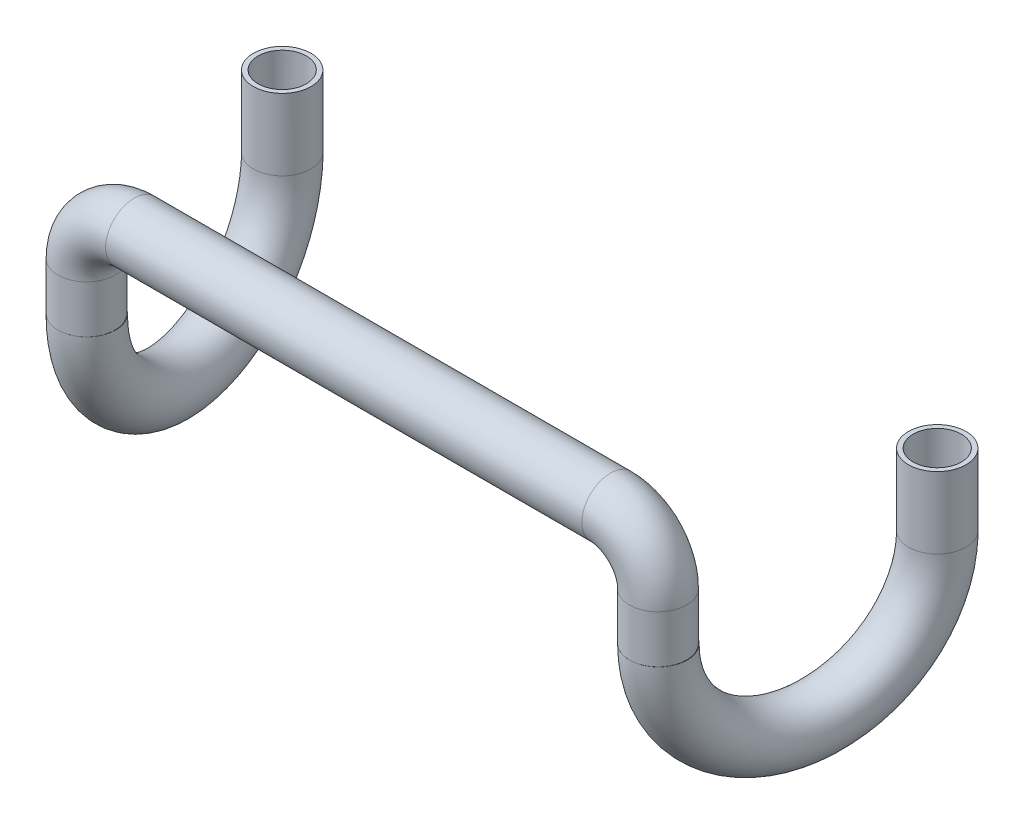
ISO-10303-21;
HEADER;
FILE_DESCRIPTION(('STEP AP214'),'2;1');
FILE_NAME('part.step','',(''),(''),'','','');
FILE_SCHEMA(('AUTOMOTIVE_DESIGN { 1 0 10303 214 1 1 1 1 }'));
ENDSEC;
DATA;
#1=APPLICATION_CONTEXT('core data for automotive mechanical design processes');
#2=APPLICATION_PROTOCOL_DEFINITION('international standard','automotive_design',2000,#1);
#3=PRODUCT_CONTEXT('',#1,'mechanical');
#4=PRODUCT('Part','Part','',(#3));
#5=PRODUCT_RELATED_PRODUCT_CATEGORY('part','',(#4));
#6=PRODUCT_DEFINITION_FORMATION('','',#4);
#7=PRODUCT_DEFINITION_CONTEXT('part definition',#1,'design');
#8=PRODUCT_DEFINITION('design','',#6,#7);
#9=PRODUCT_DEFINITION_SHAPE('','',#8);
#10=(LENGTH_UNIT() NAMED_UNIT(*) SI_UNIT(.MILLI.,.METRE.));
#11=(NAMED_UNIT(*) PLANE_ANGLE_UNIT() SI_UNIT($,.RADIAN.));
#12=(NAMED_UNIT(*) SI_UNIT($,.STERADIAN.) SOLID_ANGLE_UNIT());
#13=UNCERTAINTY_MEASURE_WITH_UNIT(LENGTH_MEASURE(1.E-05),#10,'distance_accuracy_value','');
#14=(GEOMETRIC_REPRESENTATION_CONTEXT(3) GLOBAL_UNCERTAINTY_ASSIGNED_CONTEXT((#13)) GLOBAL_UNIT_ASSIGNED_CONTEXT((#10,
#11,#12)) REPRESENTATION_CONTEXT('',''));
#15=CARTESIAN_POINT('',(0.,0.,0.));
#16=DIRECTION('',(0.,0.,1.));
#17=DIRECTION('',(1.,0.,0.));
#18=AXIS2_PLACEMENT_3D('',#15,#16,#17);
#19=CARTESIAN_POINT('',(0.,0.,0.));
#20=DIRECTION('',(1.,0.,0.));
#21=DIRECTION('',(0.,0.,-1.));
#22=AXIS2_PLACEMENT_3D('',#19,#20,#21);
#23=CYLINDRICAL_SURFACE('',#22,24.);
#24=CARTESIAN_POINT('',(200.,0.,0.));
#25=DIRECTION('',(1.,0.,0.));
#26=DIRECTION('',(0.,0.,-1.));
#27=AXIS2_PLACEMENT_3D('',#24,#25,#26);
#28=CIRCLE('',#27,24.);
#29=CARTESIAN_POINT('',(200.,24.,0.));
#30=VERTEX_POINT('',#29);
#31=EDGE_CURVE('E99',#30,#30,#28,.T.);
#32=ORIENTED_EDGE('',*,*,#31,.F.);
#33=EDGE_LOOP('',(#32));
#34=FACE_BOUND('',#33,.T.);
#35=CARTESIAN_POINT('',(-200.,0.,0.));
#36=DIRECTION('',(1.,0.,0.));
#37=DIRECTION('',(0.,0.,-1.));
#38=AXIS2_PLACEMENT_3D('',#35,#36,#37);
#39=CIRCLE('',#38,24.);
#40=CARTESIAN_POINT('',(-200.,24.,0.));
#41=VERTEX_POINT('',#40);
#42=EDGE_CURVE('E83',#41,#41,#39,.F.);
#43=ORIENTED_EDGE('',*,*,#42,.F.);
#44=EDGE_LOOP('',(#43));
#45=FACE_BOUND('',#44,.T.);
#46=ADVANCED_FACE('F34',(#34,#45),#23,.T.);
#47=CARTESIAN_POINT('',(200.,-40.,0.));
#48=DIRECTION('',(0.,0.,-1.));
#49=DIRECTION('',(-1.,0.,0.));
#50=AXIS2_PLACEMENT_3D('',#47,#48,#49);
#51=TOROIDAL_SURFACE('',#50,40.,24.);
#52=CARTESIAN_POINT('',(240.,-40.,0.));
#53=DIRECTION('',(0.,-1.,0.));
#54=DIRECTION('',(0.,0.,-1.));
#55=AXIS2_PLACEMENT_3D('',#52,#53,#54);
#56=CIRCLE('',#55,24.);
#57=CARTESIAN_POINT('',(264.,-40.,0.));
#58=VERTEX_POINT('',#57);
#59=EDGE_CURVE('E38',#58,#58,#56,.T.);
#60=CARTESIAN_POINT('',(200.,-40.,0.));
#61=DIRECTION('',(0.,0.,-1.));
#62=DIRECTION('',(-1.,0.,0.));
#63=AXIS2_PLACEMENT_3D('',#60,#61,#62);
#64=CIRCLE('',#63,64.);
#65=EDGE_CURVE('',#30,#58,#64,.T.);
#66=ORIENTED_EDGE('',*,*,#31,.T.);
#67=ORIENTED_EDGE('',*,*,#59,.F.);
#68=ORIENTED_EDGE('',*,*,#65,.T.);
#69=ORIENTED_EDGE('',*,*,#65,.F.);
#70=EDGE_LOOP('',(#66,#68,#67,#69));
#71=FACE_BOUND('',#70,.T.);
#72=ADVANCED_FACE('F116',(#71),#51,.T.);
#73=CARTESIAN_POINT('',(240.,-40.,0.));
#74=DIRECTION('',(0.,-1.,0.));
#75=DIRECTION('',(1.,0.,0.));
#76=AXIS2_PLACEMENT_3D('',#73,#74,#75);
#77=CYLINDRICAL_SURFACE('',#76,24.);
#78=CARTESIAN_POINT('',(240.,-80.,0.));
#79=DIRECTION('',(0.,-1.,0.));
#80=DIRECTION('',(0.,0.,-1.));
#81=AXIS2_PLACEMENT_3D('',#78,#79,#80);
#82=CIRCLE('',#81,24.);
#83=CARTESIAN_POINT('',(235.84098963481,-80.,23.6368913519153));
#84=VERTEX_POINT('',#83);
#85=EDGE_CURVE('E54',#84,#84,#82,.T.);
#86=ORIENTED_EDGE('',*,*,#85,.F.);
#87=EDGE_LOOP('',(#86));
#88=FACE_BOUND('',#87,.T.);
#89=ORIENTED_EDGE('',*,*,#59,.T.);
#90=EDGE_LOOP('',(#89));
#91=FACE_BOUND('',#90,.T.);
#92=ADVANCED_FACE('F36',(#88,#91),#77,.T.);
#93=CARTESIAN_POINT('',(0.,0.,0.));
#94=DIRECTION('',(1.,0.,0.));
#95=DIRECTION('',(0.,0.,-1.));
#96=AXIS2_PLACEMENT_3D('',#93,#94,#95);
#97=CYLINDRICAL_SURFACE('',#96,20.483873115775);
#98=CARTESIAN_POINT('',(200.,0.,0.));
#99=DIRECTION('',(1.,0.,0.));
#100=DIRECTION('',(0.,0.,-1.));
#101=AXIS2_PLACEMENT_3D('',#98,#99,#100);
#102=CIRCLE('',#101,20.483873115775);
#103=CARTESIAN_POINT('',(200.,20.483873115775,0.));
#104=VERTEX_POINT('',#103);
#105=EDGE_CURVE('E104',#104,#104,#102,.F.);
#106=ORIENTED_EDGE('',*,*,#105,.F.);
#107=EDGE_LOOP('',(#106));
#108=FACE_BOUND('',#107,.T.);
#109=CARTESIAN_POINT('',(-200.,0.,0.));
#110=DIRECTION('',(1.,0.,0.));
#111=DIRECTION('',(0.,0.,-1.));
#112=AXIS2_PLACEMENT_3D('',#109,#110,#111);
#113=CIRCLE('',#112,20.483873115775);
#114=CARTESIAN_POINT('',(-200.,20.483873115775,0.));
#115=VERTEX_POINT('',#114);
#116=EDGE_CURVE('E75',#115,#115,#113,.T.);
#117=ORIENTED_EDGE('',*,*,#116,.F.);
#118=EDGE_LOOP('',(#117));
#119=FACE_BOUND('',#118,.T.);
#120=ADVANCED_FACE('F122',(#108,#119),#97,.F.);
#121=CARTESIAN_POINT('',(200.,-40.,0.));
#122=DIRECTION('',(0.,0.,-1.));
#123=DIRECTION('',(-1.,0.,0.));
#124=AXIS2_PLACEMENT_3D('',#121,#122,#123);
#125=TOROIDAL_SURFACE('',#124,40.,20.483873115775);
#126=CARTESIAN_POINT('',(240.,-40.,0.));
#127=DIRECTION('',(0.,-1.,0.));
#128=DIRECTION('',(0.,0.,-1.));
#129=AXIS2_PLACEMENT_3D('',#126,#127,#128);
#130=CIRCLE('',#129,20.483873115775);
#131=CARTESIAN_POINT('',(260.483873115775,-40.,0.));
#132=VERTEX_POINT('',#131);
#133=EDGE_CURVE('E43',#132,#132,#130,.F.);
#134=CARTESIAN_POINT('',(200.,-40.,0.));
#135=DIRECTION('',(0.,0.,-1.));
#136=DIRECTION('',(-1.,0.,0.));
#137=AXIS2_PLACEMENT_3D('',#134,#135,#136);
#138=CIRCLE('',#137,60.483873115775);
#139=EDGE_CURVE('',#104,#132,#138,.T.);
#140=ORIENTED_EDGE('',*,*,#105,.T.);
#141=ORIENTED_EDGE('',*,*,#133,.F.);
#142=ORIENTED_EDGE('',*,*,#139,.T.);
#143=ORIENTED_EDGE('',*,*,#139,.F.);
#144=EDGE_LOOP('',(#140,#142,#141,#143));
#145=FACE_BOUND('',#144,.T.);
#146=ADVANCED_FACE('F128',(#145),#125,.F.);
#147=CARTESIAN_POINT('',(240.,-40.,0.));
#148=DIRECTION('',(0.,-1.,0.));
#149=DIRECTION('',(1.,0.,0.));
#150=AXIS2_PLACEMENT_3D('',#147,#148,#149);
#151=CYLINDRICAL_SURFACE('',#150,20.483873115775);
#152=CARTESIAN_POINT('',(240.,-80.,0.));
#153=DIRECTION('',(0.,-1.,0.));
#154=DIRECTION('',(0.,0.,-1.));
#155=AXIS2_PLACEMENT_3D('',#152,#153,#154);
#156=CIRCLE('',#155,20.483873115775);
#157=CARTESIAN_POINT('',(243.549693358655,-80.,-20.173961804333));
#158=VERTEX_POINT('',#157);
#159=EDGE_CURVE('E11',#158,#158,#156,.F.);
#160=ORIENTED_EDGE('',*,*,#159,.F.);
#161=EDGE_LOOP('',(#160));
#162=FACE_BOUND('',#161,.T.);
#163=ORIENTED_EDGE('',*,*,#133,.T.);
#164=EDGE_LOOP('',(#163));
#165=FACE_BOUND('',#164,.T.);
#166=ADVANCED_FACE('F126',(#162,#165),#151,.F.);
#167=CARTESIAN_POINT('',(240.035474595347,-80.,-0.201612663195141));
#168=DIRECTION('',(0.,-1.,0.));
#169=DIRECTION('',(1.,0.,0.));
#170=AXIS2_PLACEMENT_3D('',#167,#168,#169);
#171=PLANE('',#170);
#172=CARTESIAN_POINT('',(240.035474595347,-80.,-0.201612663195141));
#173=DIRECTION('',(0.,-1.,0.));
#174=DIRECTION('',(1.,0.,0.));
#175=AXIS2_PLACEMENT_3D('',#172,#173,#174);
#176=CIRCLE('',#175,24.2047098260361);
#177=EDGE_CURVE('E90',#84,#84,#176,.T.);
#178=ORIENTED_EDGE('',*,*,#177,.F.);
#179=ORIENTED_EDGE('',*,*,#85,.T.);
#180=EDGE_LOOP('',(#178,#179));
#181=FACE_BOUND('',#180,.T.);
#182=ADVANCED_FACE('F125',(#181),#171,.F.);
#183=CARTESIAN_POINT('',(240.035474595347,-80.,-0.201612663195141));
#184=DIRECTION('',(0.,-1.,0.));
#185=DIRECTION('',(1.,0.,0.));
#186=AXIS2_PLACEMENT_3D('',#183,#184,#185);
#187=CIRCLE('',#186,20.279163289739);
#188=EDGE_CURVE('E92',#158,#158,#187,.F.);
#189=ORIENTED_EDGE('',*,*,#188,.F.);
#190=ORIENTED_EDGE('',*,*,#159,.T.);
#191=EDGE_LOOP('',(#189,#190));
#192=FACE_BOUND('',#191,.T.);
#193=ADVANCED_FACE('F135',(#192),#171,.F.);
#194=CARTESIAN_POINT('',(257.561421105602,-80.,-99.8067728164823));
#195=DIRECTION('',(0.984870472996578,0.,0.173292098548945));
#196=DIRECTION('',(0.173292098548945,0.,-0.984870472996578));
#197=AXIS2_PLACEMENT_3D('',#194,#195,#196);
#198=TOROIDAL_SURFACE('',#197,101.135289242886,24.2047098260361);
#199=CARTESIAN_POINT('',(275.087367615856,-80.,-199.411932969769));
#200=DIRECTION('',(0.,1.,0.));
#201=DIRECTION('',(0.939939697161005,0.,0.341340542128938));
#202=AXIS2_PLACEMENT_3D('',#199,#200,#201);
#203=CIRCLE('',#202,24.2047098260361);
#204=CARTESIAN_POINT('',(297.83833523961,-80.,-191.149884195677));
#205=VERTEX_POINT('',#204);
#206=EDGE_CURVE('E96',#205,#205,#203,.T.);
#207=ORIENTED_EDGE('',*,*,#206,.F.);
#208=EDGE_LOOP('',(#207));
#209=FACE_BOUND('',#208,.T.);
#210=ORIENTED_EDGE('',*,*,#177,.T.);
#211=EDGE_LOOP('',(#210));
#212=FACE_BOUND('',#211,.T.);
#213=ADVANCED_FACE('F145',(#209,#212),#198,.T.);
#214=CARTESIAN_POINT('',(257.561421105602,-80.,-99.8067728164823));
#215=DIRECTION('',(0.984870472996578,0.,0.173292098548945));
#216=DIRECTION('',(0.173292098548945,0.,-0.984870472996578));
#217=AXIS2_PLACEMENT_3D('',#214,#215,#216);
#218=TOROIDAL_SURFACE('',#217,101.135289242886,20.279163289739);
#219=CARTESIAN_POINT('',(275.087367615856,-80.,-199.411932969769));
#220=DIRECTION('',(0.,1.,0.));
#221=DIRECTION('',(0.939939697161005,0.,0.341340542128938));
#222=AXIS2_PLACEMENT_3D('',#219,#220,#221);
#223=CIRCLE('',#222,20.279163289739);
#224=CARTESIAN_POINT('',(294.148558217092,-80.,-192.489832378529));
#225=VERTEX_POINT('',#224);
#226=EDGE_CURVE('E95',#225,#225,#223,.F.);
#227=ORIENTED_EDGE('',*,*,#226,.F.);
#228=EDGE_LOOP('',(#227));
#229=FACE_BOUND('',#228,.T.);
#230=ORIENTED_EDGE('',*,*,#188,.T.);
#231=EDGE_LOOP('',(#230));
#232=FACE_BOUND('',#231,.T.);
#233=ADVANCED_FACE('F147',(#229,#232),#218,.F.);
#234=CARTESIAN_POINT('',(275.087367615856,-80.,-199.411932969769));
#235=DIRECTION('',(0.,1.,0.));
#236=DIRECTION('',(-1.,0.,0.));
#237=AXIS2_PLACEMENT_3D('',#234,#235,#236);
#238=CYLINDRICAL_SURFACE('',#237,24.2047098260361);
#239=CARTESIAN_POINT('',(275.087367615856,-19.9999999999999,-199.411932969769));
#240=DIRECTION('',(0.,1.,0.));
#241=DIRECTION('',(-1.,0.,0.));
#242=AXIS2_PLACEMENT_3D('',#239,#240,#241);
#243=CIRCLE('',#242,24.2047098260361);
#244=CARTESIAN_POINT('',(250.88265778982,-19.9999999999999,-199.411932969769));
#245=VERTEX_POINT('',#244);
#246=EDGE_CURVE('E68',#245,#245,#243,.T.);
#247=ORIENTED_EDGE('',*,*,#246,.F.);
#248=EDGE_LOOP('',(#247));
#249=FACE_BOUND('',#248,.T.);
#250=ORIENTED_EDGE('',*,*,#206,.T.);
#251=EDGE_LOOP('',(#250));
#252=FACE_BOUND('',#251,.T.);
#253=ADVANCED_FACE('F153',(#249,#252),#238,.T.);
#254=CARTESIAN_POINT('',(275.087367615856,-19.9999999999999,-199.411932969769));
#255=DIRECTION('',(0.,1.,0.));
#256=DIRECTION('',(-1.,0.,0.));
#257=AXIS2_PLACEMENT_3D('',#254,#255,#256);
#258=PLANE('',#257);
#259=CARTESIAN_POINT('',(275.087367615856,-19.9999999999999,-199.411932969769));
#260=DIRECTION('',(0.,1.,0.));
#261=DIRECTION('',(-1.,0.,0.));
#262=AXIS2_PLACEMENT_3D('',#259,#260,#261);
#263=CIRCLE('',#262,20.279163289739);
#264=CARTESIAN_POINT('',(254.808204326117,-19.9999999999999,-199.411932969769));
#265=VERTEX_POINT('',#264);
#266=EDGE_CURVE('E72',#265,#265,#263,.F.);
#267=ORIENTED_EDGE('',*,*,#266,.T.);
#268=EDGE_LOOP('',(#267));
#269=FACE_BOUND('',#268,.T.);
#270=ORIENTED_EDGE('',*,*,#246,.T.);
#271=EDGE_LOOP('',(#270));
#272=FACE_BOUND('',#271,.T.);
#273=ADVANCED_FACE('F157',(#269,#272),#258,.T.);
#274=CARTESIAN_POINT('',(275.087367615856,-80.,-199.411932969769));
#275=DIRECTION('',(0.,1.,0.));
#276=DIRECTION('',(-1.,0.,0.));
#277=AXIS2_PLACEMENT_3D('',#274,#275,#276);
#278=CYLINDRICAL_SURFACE('',#277,20.279163289739);
#279=ORIENTED_EDGE('',*,*,#266,.F.);
#280=EDGE_LOOP('',(#279));
#281=FACE_BOUND('',#280,.T.);
#282=ORIENTED_EDGE('',*,*,#226,.T.);
#283=EDGE_LOOP('',(#282));
#284=FACE_BOUND('',#283,.T.);
#285=ADVANCED_FACE('F149',(#281,#284),#278,.F.);
#286=CARTESIAN_POINT('',(-200.,-40.,0.));
#287=DIRECTION('',(0.,0.,1.));
#288=DIRECTION('',(1.,0.,0.));
#289=AXIS2_PLACEMENT_3D('',#286,#287,#288);
#290=TOROIDAL_SURFACE('',#289,40.,24.);
#291=CARTESIAN_POINT('',(-240.,-40.,0.));
#292=DIRECTION('',(0.,1.,0.));
#293=DIRECTION('',(0.,0.,-1.));
#294=AXIS2_PLACEMENT_3D('',#291,#292,#293);
#295=CIRCLE('',#294,24.);
#296=CARTESIAN_POINT('',(-264.,-40.,0.));
#297=VERTEX_POINT('',#296);
#298=EDGE_CURVE('E82',#297,#297,#295,.F.);
#299=CARTESIAN_POINT('',(-200.,-40.,0.));
#300=DIRECTION('',(0.,0.,1.));
#301=DIRECTION('',(1.,0.,0.));
#302=AXIS2_PLACEMENT_3D('',#299,#300,#301);
#303=CIRCLE('',#302,64.);
#304=EDGE_CURVE('',#41,#297,#303,.T.);
#305=ORIENTED_EDGE('',*,*,#42,.T.);
#306=ORIENTED_EDGE('',*,*,#298,.F.);
#307=ORIENTED_EDGE('',*,*,#304,.T.);
#308=ORIENTED_EDGE('',*,*,#304,.F.);
#309=EDGE_LOOP('',(#305,#307,#306,#308));
#310=FACE_BOUND('',#309,.T.);
#311=ADVANCED_FACE('F164',(#310),#290,.T.);
#312=CARTESIAN_POINT('',(-240.,-40.,0.));
#313=DIRECTION('',(0.,-1.,0.));
#314=DIRECTION('',(1.,0.,0.));
#315=AXIS2_PLACEMENT_3D('',#312,#313,#314);
#316=CYLINDRICAL_SURFACE('',#315,24.);
#317=CARTESIAN_POINT('',(-240.,-80.,0.));
#318=DIRECTION('',(0.,1.,0.));
#319=DIRECTION('',(0.,0.,-1.));
#320=AXIS2_PLACEMENT_3D('',#317,#318,#319);
#321=CIRCLE('',#320,24.);
#322=CARTESIAN_POINT('',(-235.84098963481,-80.,23.6368913519153));
#323=VERTEX_POINT('',#322);
#324=EDGE_CURVE('E79',#323,#323,#321,.T.);
#325=ORIENTED_EDGE('',*,*,#324,.T.);
#326=EDGE_LOOP('',(#325));
#327=FACE_BOUND('',#326,.T.);
#328=ORIENTED_EDGE('',*,*,#298,.T.);
#329=EDGE_LOOP('',(#328));
#330=FACE_BOUND('',#329,.T.);
#331=ADVANCED_FACE('F166',(#327,#330),#316,.T.);
#332=CARTESIAN_POINT('',(-200.,-40.,0.));
#333=DIRECTION('',(0.,0.,1.));
#334=DIRECTION('',(1.,0.,0.));
#335=AXIS2_PLACEMENT_3D('',#332,#333,#334);
#336=TOROIDAL_SURFACE('',#335,40.,20.483873115775);
#337=CARTESIAN_POINT('',(-240.,-40.,0.));
#338=DIRECTION('',(0.,1.,0.));
#339=DIRECTION('',(0.,0.,-1.));
#340=AXIS2_PLACEMENT_3D('',#337,#338,#339);
#341=CIRCLE('',#340,20.483873115775);
#342=CARTESIAN_POINT('',(-260.483873115775,-40.,0.));
#343=VERTEX_POINT('',#342);
#344=EDGE_CURVE('E69',#343,#343,#341,.T.);
#345=CARTESIAN_POINT('',(-200.,-40.,0.));
#346=DIRECTION('',(0.,0.,1.));
#347=DIRECTION('',(1.,0.,0.));
#348=AXIS2_PLACEMENT_3D('',#345,#346,#347);
#349=CIRCLE('',#348,60.483873115775);
#350=EDGE_CURVE('',#115,#343,#349,.T.);
#351=ORIENTED_EDGE('',*,*,#116,.T.);
#352=ORIENTED_EDGE('',*,*,#344,.F.);
#353=ORIENTED_EDGE('',*,*,#350,.T.);
#354=ORIENTED_EDGE('',*,*,#350,.F.);
#355=EDGE_LOOP('',(#351,#353,#352,#354));
#356=FACE_BOUND('',#355,.T.);
#357=ADVANCED_FACE('F169',(#356),#336,.F.);
#358=CARTESIAN_POINT('',(-240.,-40.,0.));
#359=DIRECTION('',(0.,-1.,0.));
#360=DIRECTION('',(1.,0.,0.));
#361=AXIS2_PLACEMENT_3D('',#358,#359,#360);
#362=CYLINDRICAL_SURFACE('',#361,20.483873115775);
#363=CARTESIAN_POINT('',(-240.,-80.,0.));
#364=DIRECTION('',(0.,1.,0.));
#365=DIRECTION('',(0.,0.,-1.));
#366=AXIS2_PLACEMENT_3D('',#363,#364,#365);
#367=CIRCLE('',#366,20.483873115775);
#368=CARTESIAN_POINT('',(-243.549693358655,-80.,-20.173961804333));
#369=VERTEX_POINT('',#368);
#370=EDGE_CURVE('E62',#369,#369,#367,.T.);
#371=ORIENTED_EDGE('',*,*,#370,.F.);
#372=EDGE_LOOP('',(#371));
#373=FACE_BOUND('',#372,.T.);
#374=ORIENTED_EDGE('',*,*,#344,.T.);
#375=EDGE_LOOP('',(#374));
#376=FACE_BOUND('',#375,.T.);
#377=ADVANCED_FACE('F63',(#373,#376),#362,.F.);
#378=CARTESIAN_POINT('',(-240.035474595347,-80.,-0.201612663195141));
#379=DIRECTION('',(0.,-1.,0.));
#380=DIRECTION('',(-1.,0.,0.));
#381=AXIS2_PLACEMENT_3D('',#378,#379,#380);
#382=PLANE('',#381);
#383=CARTESIAN_POINT('',(-240.035474595347,-80.,-0.201612663195141));
#384=DIRECTION('',(0.,1.,0.));
#385=DIRECTION('',(-1.,0.,0.));
#386=AXIS2_PLACEMENT_3D('',#383,#384,#385);
#387=CIRCLE('',#386,24.2047098260361);
#388=EDGE_CURVE('E49',#323,#323,#387,.T.);
#389=ORIENTED_EDGE('',*,*,#388,.T.);
#390=ORIENTED_EDGE('',*,*,#324,.F.);
#391=EDGE_LOOP('',(#389,#390));
#392=FACE_BOUND('',#391,.T.);
#393=ADVANCED_FACE('F174',(#392),#382,.F.);
#394=CARTESIAN_POINT('',(-240.035474595347,-80.,-0.201612663195141));
#395=DIRECTION('',(0.,1.,0.));
#396=DIRECTION('',(-1.,0.,0.));
#397=AXIS2_PLACEMENT_3D('',#394,#395,#396);
#398=CIRCLE('',#397,20.279163289739);
#399=EDGE_CURVE('E211',#369,#369,#398,.T.);
#400=ORIENTED_EDGE('',*,*,#399,.F.);
#401=ORIENTED_EDGE('',*,*,#370,.T.);
#402=EDGE_LOOP('',(#400,#401));
#403=FACE_BOUND('',#402,.T.);
#404=ADVANCED_FACE('F184',(#403),#382,.F.);
#405=CARTESIAN_POINT('',(-257.561421105602,-80.,-99.8067728164823));
#406=DIRECTION('',(0.984870472996578,0.,-0.173292098548945));
#407=DIRECTION('',(-0.173292098548945,0.,-0.984870472996578));
#408=AXIS2_PLACEMENT_3D('',#405,#406,#407);
#409=TOROIDAL_SURFACE('',#408,101.135289242886,24.2047098260361);
#410=CARTESIAN_POINT('',(-275.087367615856,-80.,-199.411932969769));
#411=DIRECTION('',(0.,-1.,0.));
#412=DIRECTION('',(-0.939939697161005,0.,0.341340542128938));
#413=AXIS2_PLACEMENT_3D('',#410,#411,#412);
#414=CIRCLE('',#413,24.2047098260361);
#415=CARTESIAN_POINT('',(-297.83833523961,-80.,-191.149884195677));
#416=VERTEX_POINT('',#415);
#417=EDGE_CURVE('E213',#416,#416,#414,.T.);
#418=ORIENTED_EDGE('',*,*,#417,.T.);
#419=EDGE_LOOP('',(#418));
#420=FACE_BOUND('',#419,.T.);
#421=ORIENTED_EDGE('',*,*,#388,.F.);
#422=EDGE_LOOP('',(#421));
#423=FACE_BOUND('',#422,.T.);
#424=ADVANCED_FACE('F180',(#420,#423),#409,.T.);
#425=CARTESIAN_POINT('',(-257.561421105602,-80.,-99.8067728164823));
#426=DIRECTION('',(0.984870472996578,0.,-0.173292098548945));
#427=DIRECTION('',(-0.173292098548945,0.,-0.984870472996578));
#428=AXIS2_PLACEMENT_3D('',#425,#426,#427);
#429=TOROIDAL_SURFACE('',#428,101.135289242886,20.279163289739);
#430=CARTESIAN_POINT('',(-275.087367615856,-80.,-199.411932969769));
#431=DIRECTION('',(0.,-1.,0.));
#432=DIRECTION('',(-0.939939697161005,0.,0.341340542128938));
#433=AXIS2_PLACEMENT_3D('',#430,#431,#432);
#434=CIRCLE('',#433,20.279163289739);
#435=CARTESIAN_POINT('',(-294.148558217092,-80.,-192.489832378529));
#436=VERTEX_POINT('',#435);
#437=EDGE_CURVE('E86',#436,#436,#434,.T.);
#438=ORIENTED_EDGE('',*,*,#437,.F.);
#439=EDGE_LOOP('',(#438));
#440=FACE_BOUND('',#439,.T.);
#441=ORIENTED_EDGE('',*,*,#399,.T.);
#442=EDGE_LOOP('',(#441));
#443=FACE_BOUND('',#442,.T.);
#444=ADVANCED_FACE('F183',(#440,#443),#429,.F.);
#445=CARTESIAN_POINT('',(-275.087367615856,-80.,-199.411932969769));
#446=DIRECTION('',(0.,1.,0.));
#447=DIRECTION('',(0.,0.,1.));
#448=AXIS2_PLACEMENT_3D('',#445,#446,#447);
#449=CYLINDRICAL_SURFACE('',#448,24.2047098260361);
#450=CARTESIAN_POINT('',(-275.087367615856,-20.,-199.411932969769));
#451=DIRECTION('',(0.,1.,0.));
#452=DIRECTION('',(-1.,0.,0.));
#453=AXIS2_PLACEMENT_3D('',#450,#451,#452);
#454=CIRCLE('',#453,24.2047098260361);
#455=CARTESIAN_POINT('',(-299.292077441892,-20.,-199.411932969769));
#456=VERTEX_POINT('',#455);
#457=EDGE_CURVE('E224',#456,#456,#454,.T.);
#458=ORIENTED_EDGE('',*,*,#457,.F.);
#459=EDGE_LOOP('',(#458));
#460=FACE_BOUND('',#459,.T.);
#461=ORIENTED_EDGE('',*,*,#417,.F.);
#462=EDGE_LOOP('',(#461));
#463=FACE_BOUND('',#462,.T.);
#464=ADVANCED_FACE('F192',(#460,#463),#449,.T.);
#465=CARTESIAN_POINT('',(-275.087367615856,-20.,-199.411932969769));
#466=DIRECTION('',(0.,1.,0.));
#467=DIRECTION('',(-1.,0.,0.));
#468=AXIS2_PLACEMENT_3D('',#465,#466,#467);
#469=PLANE('',#468);
#470=CARTESIAN_POINT('',(-275.087367615856,-20.,-199.411932969769));
#471=DIRECTION('',(0.,1.,0.));
#472=DIRECTION('',(-1.,0.,0.));
#473=AXIS2_PLACEMENT_3D('',#470,#471,#472);
#474=CIRCLE('',#473,20.279163289739);
#475=CARTESIAN_POINT('',(-295.366530905595,-20.,-199.411932969769));
#476=VERTEX_POINT('',#475);
#477=EDGE_CURVE('E208',#476,#476,#474,.F.);
#478=ORIENTED_EDGE('',*,*,#477,.T.);
#479=EDGE_LOOP('',(#478));
#480=FACE_BOUND('',#479,.T.);
#481=ORIENTED_EDGE('',*,*,#457,.T.);
#482=EDGE_LOOP('',(#481));
#483=FACE_BOUND('',#482,.T.);
#484=ADVANCED_FACE('F196',(#480,#483),#469,.T.);
#485=CARTESIAN_POINT('',(-275.087367615856,-80.,-199.411932969769));
#486=DIRECTION('',(0.,1.,0.));
#487=DIRECTION('',(0.,0.,1.));
#488=AXIS2_PLACEMENT_3D('',#485,#486,#487);
#489=CYLINDRICAL_SURFACE('',#488,20.279163289739);
#490=ORIENTED_EDGE('',*,*,#477,.F.);
#491=EDGE_LOOP('',(#490));
#492=FACE_BOUND('',#491,.T.);
#493=ORIENTED_EDGE('',*,*,#437,.T.);
#494=EDGE_LOOP('',(#493));
#495=FACE_BOUND('',#494,.T.);
#496=ADVANCED_FACE('F186',(#492,#495),#489,.F.);
#497=CLOSED_SHELL('',(#46,#72,#92,#120,#146,#166,#182,#193,#213,#233,#253,#273,#285,#311,#331,
#357,#377,#393,#404,#424,#444,#464,#484,#496));
#498=MANIFOLD_SOLID_BREP('B2',#497);
#499=ADVANCED_BREP_SHAPE_REPRESENTATION('',(#18,#498),#14);
#500=SHAPE_DEFINITION_REPRESENTATION(#9,#499);
ENDSEC;
END-ISO-10303-21;
